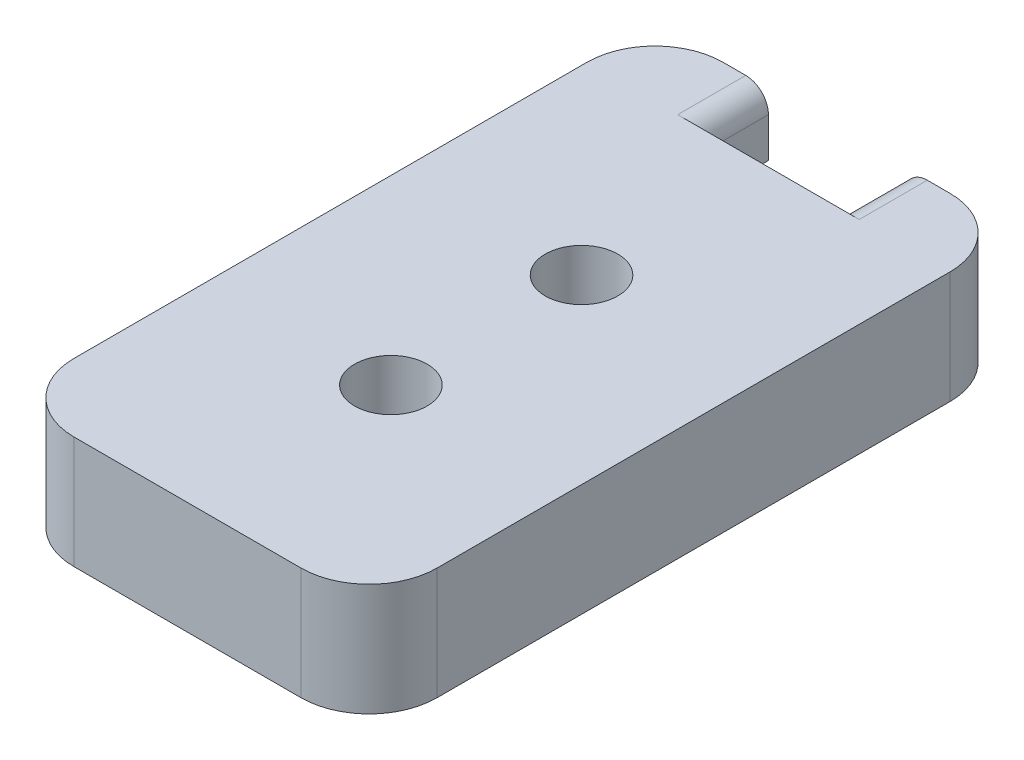
ISO-10303-21;
HEADER;
FILE_DESCRIPTION(('STEP AP214'),'2;1');
FILE_NAME('part.step','',(''),(''),'','','');
FILE_SCHEMA(('AUTOMOTIVE_DESIGN { 1 0 10303 214 1 1 1 1 }'));
ENDSEC;
DATA;
#1=APPLICATION_CONTEXT('core data for automotive mechanical design processes');
#2=APPLICATION_PROTOCOL_DEFINITION('international standard','automotive_design',2000,#1);
#3=PRODUCT_CONTEXT('',#1,'mechanical');
#4=PRODUCT('Part','Part','',(#3));
#5=PRODUCT_RELATED_PRODUCT_CATEGORY('part','',(#4));
#6=PRODUCT_DEFINITION_FORMATION('','',#4);
#7=PRODUCT_DEFINITION_CONTEXT('part definition',#1,'design');
#8=PRODUCT_DEFINITION('design','',#6,#7);
#9=PRODUCT_DEFINITION_SHAPE('','',#8);
#10=(LENGTH_UNIT() NAMED_UNIT(*) SI_UNIT(.MILLI.,.METRE.));
#11=(NAMED_UNIT(*) PLANE_ANGLE_UNIT() SI_UNIT($,.RADIAN.));
#12=(NAMED_UNIT(*) SI_UNIT($,.STERADIAN.) SOLID_ANGLE_UNIT());
#13=UNCERTAINTY_MEASURE_WITH_UNIT(LENGTH_MEASURE(1.E-05),#10,'distance_accuracy_value','');
#14=(GEOMETRIC_REPRESENTATION_CONTEXT(3) GLOBAL_UNCERTAINTY_ASSIGNED_CONTEXT((#13)) GLOBAL_UNIT_ASSIGNED_CONTEXT((#10,
#11,#12)) REPRESENTATION_CONTEXT('',''));
#15=CARTESIAN_POINT('',(0.,0.,0.));
#16=DIRECTION('',(0.,0.,1.));
#17=DIRECTION('',(1.,0.,0.));
#18=AXIS2_PLACEMENT_3D('',#15,#16,#17);
#19=CARTESIAN_POINT('',(20.,-4.94999999999999,25.6));
#20=DIRECTION('',(0.,1.,0.));
#21=DIRECTION('',(-1.,0.,0.));
#22=AXIS2_PLACEMENT_3D('',#19,#20,#21);
#23=PLANE('',#22);
#24=CARTESIAN_POINT('',(9.99999999998913,-4.94999999999999,8.23674059051232));
#25=DIRECTION('',(0.,1.,0.));
#26=DIRECTION('',(0.,0.,1.));
#27=AXIS2_PLACEMENT_3D('',#24,#25,#26);
#28=CIRCLE('',#27,1.60000000001062);
#29=CARTESIAN_POINT('',(9.99999999998913,-4.94999999999999,9.83674059052293));
#30=VERTEX_POINT('',#29);
#31=EDGE_CURVE('E193',#30,#30,#28,.T.);
#32=ORIENTED_EDGE('',*,*,#31,.T.);
#33=EDGE_LOOP('',(#32));
#34=FACE_BOUND('',#33,.T.);
#35=CARTESIAN_POINT('',(9.99999999998913,-4.94999999999999,16.6367405905123));
#36=DIRECTION('',(0.,1.,0.));
#37=DIRECTION('',(0.,0.,1.));
#38=AXIS2_PLACEMENT_3D('',#35,#36,#37);
#39=CIRCLE('',#38,1.60000000001062);
#40=CARTESIAN_POINT('',(9.99999999998913,-4.94999999999999,18.2367405905229));
#41=VERTEX_POINT('',#40);
#42=EDGE_CURVE('E200',#41,#41,#39,.T.);
#43=ORIENTED_EDGE('',*,*,#42,.T.);
#44=EDGE_LOOP('',(#43));
#45=FACE_BOUND('',#44,.T.);
#46=DIRECTION('',(0.,0.,-1.));
#47=VECTOR('',#46,1.);
#48=CARTESIAN_POINT('',(18.,-4.94999999999999,25.6));
#49=LINE('',#48,#47);
#50=CARTESIAN_POINT('',(18.,-4.94999999999999,22.6));
#51=VERTEX_POINT('',#50);
#52=CARTESIAN_POINT('',(18.,-4.94999999999999,0.));
#53=VERTEX_POINT('',#52);
#54=EDGE_CURVE('E287',#51,#53,#49,.T.);
#55=ORIENTED_EDGE('',*,*,#54,.F.);
#56=CARTESIAN_POINT('',(15.,-4.94999999999999,22.6));
#57=DIRECTION('',(0.,1.,0.));
#58=DIRECTION('',(-1.,0.,0.));
#59=AXIS2_PLACEMENT_3D('',#56,#57,#58);
#60=CIRCLE('',#59,3.);
#61=CARTESIAN_POINT('',(15.,-4.94999999999999,25.6));
#62=VERTEX_POINT('',#61);
#63=EDGE_CURVE('E254',#51,#62,#60,.F.);
#64=ORIENTED_EDGE('',*,*,#63,.T.);
#65=DIRECTION('',(1.,0.,0.));
#66=VECTOR('',#65,1.);
#67=CARTESIAN_POINT('',(20.,-4.94999999999999,25.6));
#68=LINE('',#67,#66);
#69=CARTESIAN_POINT('',(5.,-4.94999999999999,25.6));
#70=VERTEX_POINT('',#69);
#71=EDGE_CURVE('E196',#70,#62,#68,.T.);
#72=ORIENTED_EDGE('',*,*,#71,.F.);
#73=CARTESIAN_POINT('',(5.,-4.94999999999999,22.6));
#74=DIRECTION('',(0.,1.,0.));
#75=DIRECTION('',(-1.,0.,0.));
#76=AXIS2_PLACEMENT_3D('',#73,#74,#75);
#77=CIRCLE('',#76,3.);
#78=CARTESIAN_POINT('',(2.,-4.94999999999999,22.6));
#79=VERTEX_POINT('',#78);
#80=EDGE_CURVE('E252',#70,#79,#77,.F.);
#81=ORIENTED_EDGE('',*,*,#80,.T.);
#82=DIRECTION('',(0.,0.,-1.));
#83=VECTOR('',#82,1.);
#84=CARTESIAN_POINT('',(2.,-4.94999999999999,25.6));
#85=LINE('',#84,#83);
#86=CARTESIAN_POINT('',(2.,-4.94999999999999,0.));
#87=VERTEX_POINT('',#86);
#88=EDGE_CURVE('E268',#79,#87,#85,.T.);
#89=ORIENTED_EDGE('',*,*,#88,.T.);
#90=CARTESIAN_POINT('',(5.,-4.94999999999999,0.));
#91=DIRECTION('',(0.,1.,0.));
#92=DIRECTION('',(-1.,0.,0.));
#93=AXIS2_PLACEMENT_3D('',#90,#91,#92);
#94=CIRCLE('',#93,3.);
#95=CARTESIAN_POINT('',(5.,-4.94999999999999,-3.));
#96=VERTEX_POINT('',#95);
#97=EDGE_CURVE('E48',#87,#96,#94,.F.);
#98=ORIENTED_EDGE('',*,*,#97,.T.);
#99=DIRECTION('',(-1.,0.,0.));
#100=VECTOR('',#99,1.);
#101=CARTESIAN_POINT('',(20.,-4.94999999999999,-3.));
#102=LINE('',#101,#100);
#103=CARTESIAN_POINT('',(15.,-4.94999999999999,-3.));
#104=VERTEX_POINT('',#103);
#105=EDGE_CURVE('E174',#104,#96,#102,.T.);
#106=ORIENTED_EDGE('',*,*,#105,.F.);
#107=CARTESIAN_POINT('',(15.,-4.94999999999999,0.));
#108=DIRECTION('',(0.,1.,0.));
#109=DIRECTION('',(-1.,0.,0.));
#110=AXIS2_PLACEMENT_3D('',#107,#108,#109);
#111=CIRCLE('',#110,3.);
#112=EDGE_CURVE('E249',#104,#53,#111,.F.);
#113=ORIENTED_EDGE('',*,*,#112,.T.);
#114=EDGE_LOOP('',(#55,#64,#72,#81,#89,#98,#106,#113));
#115=FACE_BOUND('',#114,.T.);
#116=ADVANCED_FACE('F33',(#34,#45,#115),#23,.F.);
#117=CARTESIAN_POINT('',(0.,0.,25.6));
#118=DIRECTION('',(0.,-1.,0.));
#119=DIRECTION('',(0.,0.,-1.));
#120=AXIS2_PLACEMENT_3D('',#117,#118,#119);
#121=PLANE('',#120);
#122=CARTESIAN_POINT('',(9.99999999998913,0.,8.23674059051232));
#123=DIRECTION('',(0.,1.,0.));
#124=DIRECTION('',(0.,0.,1.));
#125=AXIS2_PLACEMENT_3D('',#122,#123,#124);
#126=CIRCLE('',#125,1.60000000001062);
#127=CARTESIAN_POINT('',(9.99999999998913,0.,9.83674059052293));
#128=VERTEX_POINT('',#127);
#129=EDGE_CURVE('E197',#128,#128,#126,.T.);
#130=ORIENTED_EDGE('',*,*,#129,.F.);
#131=EDGE_LOOP('',(#130));
#132=FACE_BOUND('',#131,.T.);
#133=CARTESIAN_POINT('',(9.99999999998913,0.,16.6367405905123));
#134=DIRECTION('',(0.,1.,0.));
#135=DIRECTION('',(0.,0.,1.));
#136=AXIS2_PLACEMENT_3D('',#133,#134,#135);
#137=CIRCLE('',#136,1.60000000001062);
#138=CARTESIAN_POINT('',(9.99999999998913,0.,18.2367405905229));
#139=VERTEX_POINT('',#138);
#140=EDGE_CURVE('E192',#139,#139,#137,.T.);
#141=ORIENTED_EDGE('',*,*,#140,.F.);
#142=EDGE_LOOP('',(#141));
#143=FACE_BOUND('',#142,.T.);
#144=DIRECTION('',(-1.,0.,0.));
#145=VECTOR('',#144,1.);
#146=CARTESIAN_POINT('',(0.,0.,25.6));
#147=LINE('',#146,#145);
#148=CARTESIAN_POINT('',(15.,0.,25.6));
#149=VERTEX_POINT('',#148);
#150=CARTESIAN_POINT('',(5.,0.,25.6));
#151=VERTEX_POINT('',#150);
#152=EDGE_CURVE('E207',#149,#151,#147,.T.);
#153=ORIENTED_EDGE('',*,*,#152,.F.);
#154=CARTESIAN_POINT('',(15.,0.,22.6));
#155=DIRECTION('',(0.,-1.,0.));
#156=DIRECTION('',(0.,0.,-1.));
#157=AXIS2_PLACEMENT_3D('',#154,#155,#156);
#158=CIRCLE('',#157,3.);
#159=CARTESIAN_POINT('',(18.,0.,22.6));
#160=VERTEX_POINT('',#159);
#161=EDGE_CURVE('E242',#149,#160,#158,.F.);
#162=ORIENTED_EDGE('',*,*,#161,.T.);
#163=DIRECTION('',(0.,0.,-1.));
#164=VECTOR('',#163,1.);
#165=CARTESIAN_POINT('',(18.,0.,25.6));
#166=LINE('',#165,#164);
#167=CARTESIAN_POINT('',(18.,0.,0.));
#168=VERTEX_POINT('',#167);
#169=EDGE_CURVE('E276',#160,#168,#166,.T.);
#170=ORIENTED_EDGE('',*,*,#169,.T.);
#171=CARTESIAN_POINT('',(15.,0.,0.));
#172=DIRECTION('',(0.,-1.,0.));
#173=DIRECTION('',(0.,0.,-1.));
#174=AXIS2_PLACEMENT_3D('',#171,#172,#173);
#175=CIRCLE('',#174,3.);
#176=CARTESIAN_POINT('',(15.,0.,-3.));
#177=VERTEX_POINT('',#176);
#178=EDGE_CURVE('E236',#168,#177,#175,.F.);
#179=ORIENTED_EDGE('',*,*,#178,.T.);
#180=DIRECTION('',(1.,0.,0.));
#181=VECTOR('',#180,1.);
#182=CARTESIAN_POINT('',(0.,0.,-3.));
#183=LINE('',#182,#181);
#184=CARTESIAN_POINT('',(14.,0.,-3.));
#185=VERTEX_POINT('',#184);
#186=EDGE_CURVE('E189',#185,#177,#183,.T.);
#187=ORIENTED_EDGE('',*,*,#186,.F.);
#188=DIRECTION('',(0.,0.,-1.));
#189=VECTOR('',#188,1.);
#190=CARTESIAN_POINT('',(14.,0.,25.6));
#191=LINE('',#190,#189);
#192=CARTESIAN_POINT('',(14.,0.,0.));
#193=VERTEX_POINT('',#192);
#194=EDGE_CURVE('E210',#185,#193,#191,.F.);
#195=ORIENTED_EDGE('',*,*,#194,.T.);
#196=DIRECTION('',(1.,0.,0.));
#197=VECTOR('',#196,1.);
#198=CARTESIAN_POINT('',(10.,0.,0.));
#199=LINE('',#198,#197);
#200=CARTESIAN_POINT('',(6.,0.,0.));
#201=VERTEX_POINT('',#200);
#202=EDGE_CURVE('E176',#201,#193,#199,.T.);
#203=ORIENTED_EDGE('',*,*,#202,.F.);
#204=DIRECTION('',(0.,0.,-1.));
#205=VECTOR('',#204,1.);
#206=CARTESIAN_POINT('',(6.,0.,25.6));
#207=LINE('',#206,#205);
#208=CARTESIAN_POINT('',(6.,0.,-3.));
#209=VERTEX_POINT('',#208);
#210=EDGE_CURVE('E213',#201,#209,#207,.T.);
#211=ORIENTED_EDGE('',*,*,#210,.T.);
#212=CARTESIAN_POINT('',(5.,0.,-3.));
#213=VERTEX_POINT('',#212);
#214=EDGE_CURVE('E190',#213,#209,#183,.T.);
#215=ORIENTED_EDGE('',*,*,#214,.F.);
#216=CARTESIAN_POINT('',(5.,0.,0.));
#217=DIRECTION('',(0.,-1.,0.));
#218=DIRECTION('',(0.,0.,-1.));
#219=AXIS2_PLACEMENT_3D('',#216,#217,#218);
#220=CIRCLE('',#219,3.);
#221=CARTESIAN_POINT('',(2.,0.,0.));
#222=VERTEX_POINT('',#221);
#223=EDGE_CURVE('E238',#213,#222,#220,.F.);
#224=ORIENTED_EDGE('',*,*,#223,.T.);
#225=DIRECTION('',(0.,0.,-1.));
#226=VECTOR('',#225,1.);
#227=CARTESIAN_POINT('',(2.,0.,25.6));
#228=LINE('',#227,#226);
#229=CARTESIAN_POINT('',(2.,0.,22.6));
#230=VERTEX_POINT('',#229);
#231=EDGE_CURVE('E266',#230,#222,#228,.T.);
#232=ORIENTED_EDGE('',*,*,#231,.F.);
#233=CARTESIAN_POINT('',(5.,0.,22.6));
#234=DIRECTION('',(0.,-1.,0.));
#235=DIRECTION('',(0.,0.,-1.));
#236=AXIS2_PLACEMENT_3D('',#233,#234,#235);
#237=CIRCLE('',#236,3.);
#238=EDGE_CURVE('E240',#230,#151,#237,.F.);
#239=ORIENTED_EDGE('',*,*,#238,.T.);
#240=EDGE_LOOP('',(#153,#162,#170,#179,#187,#195,#203,#211,#215,#224,#232,#239));
#241=FACE_BOUND('',#240,.T.);
#242=ADVANCED_FACE('F273',(#132,#143,#241),#121,.F.);
#243=CARTESIAN_POINT('',(0.,0.,25.6));
#244=DIRECTION('',(0.,0.,-1.));
#245=DIRECTION('',(-1.,0.,0.));
#246=AXIS2_PLACEMENT_3D('',#243,#244,#245);
#247=PLANE('',#246);
#248=ORIENTED_EDGE('',*,*,#71,.T.);
#249=DIRECTION('',(0.,1.,0.));
#250=VECTOR('',#249,1.);
#251=CARTESIAN_POINT('',(15.,0.,25.6));
#252=LINE('',#251,#250);
#253=EDGE_CURVE('E233',#62,#149,#252,.T.);
#254=ORIENTED_EDGE('',*,*,#253,.T.);
#255=ORIENTED_EDGE('',*,*,#152,.T.);
#256=DIRECTION('',(0.,-1.,0.));
#257=VECTOR('',#256,1.);
#258=CARTESIAN_POINT('',(5.,0.,25.6));
#259=LINE('',#258,#257);
#260=EDGE_CURVE('E230',#151,#70,#259,.T.);
#261=ORIENTED_EDGE('',*,*,#260,.T.);
#262=EDGE_LOOP('',(#248,#254,#255,#261));
#263=FACE_BOUND('',#262,.T.);
#264=ADVANCED_FACE('F282',(#263),#247,.F.);
#265=CARTESIAN_POINT('',(9.99999999998913,-4.94999999999999,16.6367405905123));
#266=DIRECTION('',(0.,1.,0.));
#267=DIRECTION('',(0.,0.,1.));
#268=AXIS2_PLACEMENT_3D('',#265,#266,#267);
#269=CYLINDRICAL_SURFACE('',#268,1.60000000001062);
#270=ORIENTED_EDGE('',*,*,#42,.F.);
#271=EDGE_LOOP('',(#270));
#272=FACE_BOUND('',#271,.T.);
#273=ORIENTED_EDGE('',*,*,#140,.T.);
#274=EDGE_LOOP('',(#273));
#275=FACE_BOUND('',#274,.T.);
#276=ADVANCED_FACE('F462',(#272,#275),#269,.F.);
#277=CARTESIAN_POINT('',(9.99999999998913,-4.94999999999999,8.23674059051232));
#278=DIRECTION('',(0.,1.,0.));
#279=DIRECTION('',(0.,0.,1.));
#280=AXIS2_PLACEMENT_3D('',#277,#278,#279);
#281=CYLINDRICAL_SURFACE('',#280,1.60000000001062);
#282=ORIENTED_EDGE('',*,*,#31,.F.);
#283=EDGE_LOOP('',(#282));
#284=FACE_BOUND('',#283,.T.);
#285=ORIENTED_EDGE('',*,*,#129,.T.);
#286=EDGE_LOOP('',(#285));
#287=FACE_BOUND('',#286,.T.);
#288=ADVANCED_FACE('F458',(#284,#287),#281,.F.);
#289=CARTESIAN_POINT('',(0.,0.,-3.));
#290=DIRECTION('',(0.,0.,-1.));
#291=DIRECTION('',(-1.,0.,0.));
#292=AXIS2_PLACEMENT_3D('',#289,#290,#291);
#293=PLANE('',#292);
#294=ORIENTED_EDGE('',*,*,#105,.T.);
#295=DIRECTION('',(0.,-1.,0.));
#296=VECTOR('',#295,1.);
#297=CARTESIAN_POINT('',(5.,0.,-3.));
#298=LINE('',#297,#296);
#299=EDGE_CURVE('E11',#96,#213,#298,.F.);
#300=ORIENTED_EDGE('',*,*,#299,.T.);
#301=ORIENTED_EDGE('',*,*,#214,.T.);
#302=CARTESIAN_POINT('',(6.,-1.,-3.));
#303=DIRECTION('',(0.,0.,-1.));
#304=DIRECTION('',(-1.,0.,0.));
#305=AXIS2_PLACEMENT_3D('',#302,#303,#304);
#306=CIRCLE('',#305,1.);
#307=CARTESIAN_POINT('',(7.,-1.,-3.));
#308=VERTEX_POINT('',#307);
#309=EDGE_CURVE('E218',#209,#308,#306,.T.);
#310=ORIENTED_EDGE('',*,*,#309,.T.);
#311=DIRECTION('',(0.,1.,0.));
#312=VECTOR('',#311,1.);
#313=CARTESIAN_POINT('',(7.,-3.,-3.));
#314=LINE('',#313,#312);
#315=CARTESIAN_POINT('',(7.,-2.75,-3.));
#316=VERTEX_POINT('',#315);
#317=EDGE_CURVE('E185',#316,#308,#314,.T.);
#318=ORIENTED_EDGE('',*,*,#317,.F.);
#319=CARTESIAN_POINT('',(7.,-3.,-3.));
#320=DIRECTION('',(0.,0.,-1.));
#321=DIRECTION('',(-1.,0.,0.));
#322=AXIS2_PLACEMENT_3D('',#319,#320,#321);
#323=CIRCLE('',#322,0.249999999999999);
#324=CARTESIAN_POINT('',(7.25,-3.,-3.));
#325=VERTEX_POINT('',#324);
#326=EDGE_CURVE('E167',#325,#316,#323,.T.);
#327=ORIENTED_EDGE('',*,*,#326,.F.);
#328=DIRECTION('',(-1.,0.,0.));
#329=VECTOR('',#328,1.);
#330=CARTESIAN_POINT('',(13.,-3.,-3.));
#331=LINE('',#330,#329);
#332=CARTESIAN_POINT('',(12.75,-3.,-3.));
#333=VERTEX_POINT('',#332);
#334=EDGE_CURVE('E182',#333,#325,#331,.T.);
#335=ORIENTED_EDGE('',*,*,#334,.F.);
#336=CARTESIAN_POINT('',(13.,-3.,-3.));
#337=DIRECTION('',(0.,0.,-1.));
#338=DIRECTION('',(-1.,0.,0.));
#339=AXIS2_PLACEMENT_3D('',#336,#337,#338);
#340=CIRCLE('',#339,0.250000000000001);
#341=CARTESIAN_POINT('',(13.,-2.75,-3.));
#342=VERTEX_POINT('',#341);
#343=EDGE_CURVE('E152',#342,#333,#340,.T.);
#344=ORIENTED_EDGE('',*,*,#343,.F.);
#345=DIRECTION('',(0.,-1.,0.));
#346=VECTOR('',#345,1.);
#347=CARTESIAN_POINT('',(13.,0.,-3.));
#348=LINE('',#347,#346);
#349=CARTESIAN_POINT('',(13.,-1.,-3.));
#350=VERTEX_POINT('',#349);
#351=EDGE_CURVE('E180',#350,#342,#348,.T.);
#352=ORIENTED_EDGE('',*,*,#351,.F.);
#353=CARTESIAN_POINT('',(14.,-1.,-3.));
#354=DIRECTION('',(0.,0.,-1.));
#355=DIRECTION('',(-1.,0.,0.));
#356=AXIS2_PLACEMENT_3D('',#353,#354,#355);
#357=CIRCLE('',#356,1.);
#358=EDGE_CURVE('E216',#350,#185,#357,.T.);
#359=ORIENTED_EDGE('',*,*,#358,.T.);
#360=ORIENTED_EDGE('',*,*,#186,.T.);
#361=DIRECTION('',(0.,1.,0.));
#362=VECTOR('',#361,1.);
#363=CARTESIAN_POINT('',(15.,-4.94999999999999,-3.));
#364=LINE('',#363,#362);
#365=EDGE_CURVE('E41',#177,#104,#364,.F.);
#366=ORIENTED_EDGE('',*,*,#365,.T.);
#367=EDGE_LOOP('',(#294,#300,#301,#310,#318,#327,#335,#344,#352,#359,#360,#366));
#368=FACE_BOUND('',#367,.T.);
#369=ADVANCED_FACE('F318',(#368),#293,.T.);
#370=CARTESIAN_POINT('',(7.,-3.,0.));
#371=DIRECTION('',(-1.,0.,0.));
#372=DIRECTION('',(0.,0.,1.));
#373=AXIS2_PLACEMENT_3D('',#370,#371,#372);
#374=PLANE('',#373);
#375=ORIENTED_EDGE('',*,*,#317,.T.);
#376=DIRECTION('',(0.,0.,-1.));
#377=VECTOR('',#376,1.);
#378=CARTESIAN_POINT('',(7.,-1.,0.));
#379=LINE('',#378,#377);
#380=CARTESIAN_POINT('',(7.,-1.,0.));
#381=VERTEX_POINT('',#380);
#382=EDGE_CURVE('E220',#308,#381,#379,.F.);
#383=ORIENTED_EDGE('',*,*,#382,.T.);
#384=DIRECTION('',(0.,1.,0.));
#385=VECTOR('',#384,1.);
#386=CARTESIAN_POINT('',(7.,-3.,0.));
#387=LINE('',#386,#385);
#388=CARTESIAN_POINT('',(7.,-2.75,0.));
#389=VERTEX_POINT('',#388);
#390=EDGE_CURVE('E171',#389,#381,#387,.T.);
#391=ORIENTED_EDGE('',*,*,#390,.F.);
#392=DIRECTION('',(0.,0.,-1.));
#393=VECTOR('',#392,1.);
#394=CARTESIAN_POINT('',(7.,-2.75,0.));
#395=LINE('',#394,#393);
#396=EDGE_CURVE('E183',#389,#316,#395,.T.);
#397=ORIENTED_EDGE('',*,*,#396,.T.);
#398=EDGE_LOOP('',(#375,#383,#391,#397));
#399=FACE_BOUND('',#398,.T.);
#400=ADVANCED_FACE('F325',(#399),#374,.F.);
#401=CARTESIAN_POINT('',(13.,-3.,0.));
#402=DIRECTION('',(0.,-1.,0.));
#403=DIRECTION('',(0.,0.,-1.));
#404=AXIS2_PLACEMENT_3D('',#401,#402,#403);
#405=PLANE('',#404);
#406=ORIENTED_EDGE('',*,*,#334,.T.);
#407=DIRECTION('',(0.,0.,-1.));
#408=VECTOR('',#407,1.);
#409=CARTESIAN_POINT('',(7.25,-3.,0.));
#410=LINE('',#409,#408);
#411=CARTESIAN_POINT('',(7.25,-3.,0.));
#412=VERTEX_POINT('',#411);
#413=EDGE_CURVE('E157',#325,#412,#410,.F.);
#414=ORIENTED_EDGE('',*,*,#413,.T.);
#415=DIRECTION('',(-1.,0.,0.));
#416=VECTOR('',#415,1.);
#417=CARTESIAN_POINT('',(13.,-3.,0.));
#418=LINE('',#417,#416);
#419=CARTESIAN_POINT('',(12.75,-3.,0.));
#420=VERTEX_POINT('',#419);
#421=EDGE_CURVE('E164',#420,#412,#418,.T.);
#422=ORIENTED_EDGE('',*,*,#421,.F.);
#423=DIRECTION('',(0.,0.,-1.));
#424=VECTOR('',#423,1.);
#425=CARTESIAN_POINT('',(12.75,-3.,0.));
#426=LINE('',#425,#424);
#427=EDGE_CURVE('E145',#420,#333,#426,.T.);
#428=ORIENTED_EDGE('',*,*,#427,.T.);
#429=EDGE_LOOP('',(#406,#414,#422,#428));
#430=FACE_BOUND('',#429,.T.);
#431=ADVANCED_FACE('F170',(#430),#405,.F.);
#432=CARTESIAN_POINT('',(13.,0.,0.));
#433=DIRECTION('',(1.,0.,0.));
#434=DIRECTION('',(0.,0.,-1.));
#435=AXIS2_PLACEMENT_3D('',#432,#433,#434);
#436=PLANE('',#435);
#437=DIRECTION('',(0.,-1.,0.));
#438=VECTOR('',#437,1.);
#439=CARTESIAN_POINT('',(13.,0.,0.));
#440=LINE('',#439,#438);
#441=CARTESIAN_POINT('',(13.,-1.,0.));
#442=VERTEX_POINT('',#441);
#443=CARTESIAN_POINT('',(13.,-2.75,0.));
#444=VERTEX_POINT('',#443);
#445=EDGE_CURVE('E166',#442,#444,#440,.T.);
#446=ORIENTED_EDGE('',*,*,#445,.F.);
#447=DIRECTION('',(0.,0.,-1.));
#448=VECTOR('',#447,1.);
#449=CARTESIAN_POINT('',(13.,-1.,0.));
#450=LINE('',#449,#448);
#451=EDGE_CURVE('E222',#442,#350,#450,.T.);
#452=ORIENTED_EDGE('',*,*,#451,.T.);
#453=ORIENTED_EDGE('',*,*,#351,.T.);
#454=DIRECTION('',(0.,0.,-1.));
#455=VECTOR('',#454,1.);
#456=CARTESIAN_POINT('',(13.,-2.75,0.));
#457=LINE('',#456,#455);
#458=EDGE_CURVE('E158',#342,#444,#457,.F.);
#459=ORIENTED_EDGE('',*,*,#458,.T.);
#460=EDGE_LOOP('',(#446,#452,#453,#459));
#461=FACE_BOUND('',#460,.T.);
#462=ADVANCED_FACE('F317',(#461),#436,.F.);
#463=CARTESIAN_POINT('',(0.,0.,0.));
#464=DIRECTION('',(0.,0.,-1.));
#465=DIRECTION('',(-1.,0.,0.));
#466=AXIS2_PLACEMENT_3D('',#463,#464,#465);
#467=PLANE('',#466);
#468=CARTESIAN_POINT('',(7.,-3.,0.));
#469=DIRECTION('',(0.,0.,-1.));
#470=DIRECTION('',(-1.,0.,0.));
#471=AXIS2_PLACEMENT_3D('',#468,#469,#470);
#472=CIRCLE('',#471,0.249999999999999);
#473=EDGE_CURVE('E300',#412,#389,#472,.T.);
#474=ORIENTED_EDGE('',*,*,#473,.T.);
#475=ORIENTED_EDGE('',*,*,#390,.T.);
#476=CARTESIAN_POINT('',(6.,-1.,0.));
#477=DIRECTION('',(0.,0.,-1.));
#478=DIRECTION('',(-1.,0.,0.));
#479=AXIS2_PLACEMENT_3D('',#476,#477,#478);
#480=CIRCLE('',#479,1.);
#481=EDGE_CURVE('E225',#381,#201,#480,.F.);
#482=ORIENTED_EDGE('',*,*,#481,.T.);
#483=ORIENTED_EDGE('',*,*,#202,.T.);
#484=CARTESIAN_POINT('',(14.,-1.,0.));
#485=DIRECTION('',(0.,0.,-1.));
#486=DIRECTION('',(-1.,0.,0.));
#487=AXIS2_PLACEMENT_3D('',#484,#485,#486);
#488=CIRCLE('',#487,1.);
#489=EDGE_CURVE('E228',#193,#442,#488,.F.);
#490=ORIENTED_EDGE('',*,*,#489,.T.);
#491=ORIENTED_EDGE('',*,*,#445,.T.);
#492=CARTESIAN_POINT('',(13.,-3.,0.));
#493=DIRECTION('',(0.,0.,-1.));
#494=DIRECTION('',(-1.,0.,0.));
#495=AXIS2_PLACEMENT_3D('',#492,#493,#494);
#496=CIRCLE('',#495,0.250000000000001);
#497=EDGE_CURVE('E149',#444,#420,#496,.T.);
#498=ORIENTED_EDGE('',*,*,#497,.T.);
#499=ORIENTED_EDGE('',*,*,#421,.T.);
#500=EDGE_LOOP('',(#474,#475,#482,#483,#490,#491,#498,#499));
#501=FACE_BOUND('',#500,.T.);
#502=ADVANCED_FACE('F163',(#501),#467,.T.);
#503=CARTESIAN_POINT('',(13.,-3.,0.));
#504=DIRECTION('',(0.,0.,-1.));
#505=DIRECTION('',(-1.,0.,0.));
#506=AXIS2_PLACEMENT_3D('',#503,#504,#505);
#507=CYLINDRICAL_SURFACE('',#506,0.250000000000001);
#508=ORIENTED_EDGE('',*,*,#497,.F.);
#509=ORIENTED_EDGE('',*,*,#458,.F.);
#510=ORIENTED_EDGE('',*,*,#343,.T.);
#511=ORIENTED_EDGE('',*,*,#427,.F.);
#512=EDGE_LOOP('',(#508,#509,#510,#511));
#513=FACE_BOUND('',#512,.T.);
#514=ADVANCED_FACE('F147',(#513),#507,.F.);
#515=CARTESIAN_POINT('',(7.,-3.,0.));
#516=DIRECTION('',(0.,0.,-1.));
#517=DIRECTION('',(-1.,0.,0.));
#518=AXIS2_PLACEMENT_3D('',#515,#516,#517);
#519=CYLINDRICAL_SURFACE('',#518,0.249999999999999);
#520=ORIENTED_EDGE('',*,*,#473,.F.);
#521=ORIENTED_EDGE('',*,*,#413,.F.);
#522=ORIENTED_EDGE('',*,*,#326,.T.);
#523=ORIENTED_EDGE('',*,*,#396,.F.);
#524=EDGE_LOOP('',(#520,#521,#522,#523));
#525=FACE_BOUND('',#524,.T.);
#526=ADVANCED_FACE('F322',(#525),#519,.F.);
#527=CARTESIAN_POINT('',(6.,-1.,25.6));
#528=DIRECTION('',(0.,0.,-1.));
#529=DIRECTION('',(-1.,0.,0.));
#530=AXIS2_PLACEMENT_3D('',#527,#528,#529);
#531=CYLINDRICAL_SURFACE('',#530,1.);
#532=ORIENTED_EDGE('',*,*,#481,.F.);
#533=ORIENTED_EDGE('',*,*,#382,.F.);
#534=ORIENTED_EDGE('',*,*,#309,.F.);
#535=ORIENTED_EDGE('',*,*,#210,.F.);
#536=EDGE_LOOP('',(#532,#533,#534,#535));
#537=FACE_BOUND('',#536,.T.);
#538=ADVANCED_FACE('F328',(#537),#531,.T.);
#539=CARTESIAN_POINT('',(14.,-1.,0.));
#540=DIRECTION('',(0.,0.,-1.));
#541=DIRECTION('',(-1.,0.,0.));
#542=AXIS2_PLACEMENT_3D('',#539,#540,#541);
#543=CYLINDRICAL_SURFACE('',#542,1.);
#544=ORIENTED_EDGE('',*,*,#489,.F.);
#545=ORIENTED_EDGE('',*,*,#194,.F.);
#546=ORIENTED_EDGE('',*,*,#358,.F.);
#547=ORIENTED_EDGE('',*,*,#451,.F.);
#548=EDGE_LOOP('',(#544,#545,#546,#547));
#549=FACE_BOUND('',#548,.T.);
#550=ADVANCED_FACE('F314',(#549),#543,.T.);
#551=CARTESIAN_POINT('',(18.,0.,25.6));
#552=DIRECTION('',(-1.,0.,0.));
#553=DIRECTION('',(0.,0.,1.));
#554=AXIS2_PLACEMENT_3D('',#551,#552,#553);
#555=PLANE('',#554);
#556=ORIENTED_EDGE('',*,*,#169,.F.);
#557=DIRECTION('',(0.,1.,0.));
#558=VECTOR('',#557,1.);
#559=CARTESIAN_POINT('',(18.,0.,22.6));
#560=LINE('',#559,#558);
#561=EDGE_CURVE('E247',#160,#51,#560,.F.);
#562=ORIENTED_EDGE('',*,*,#561,.T.);
#563=ORIENTED_EDGE('',*,*,#54,.T.);
#564=DIRECTION('',(0.,1.,0.));
#565=VECTOR('',#564,1.);
#566=CARTESIAN_POINT('',(18.,0.,0.));
#567=LINE('',#566,#565);
#568=EDGE_CURVE('E244',#53,#168,#567,.T.);
#569=ORIENTED_EDGE('',*,*,#568,.T.);
#570=EDGE_LOOP('',(#556,#562,#563,#569));
#571=FACE_BOUND('',#570,.T.);
#572=ADVANCED_FACE('F294',(#571),#555,.F.);
#573=CARTESIAN_POINT('',(2.,0.,25.6));
#574=DIRECTION('',(1.,0.,0.));
#575=DIRECTION('',(0.,1.,0.));
#576=AXIS2_PLACEMENT_3D('',#573,#574,#575);
#577=PLANE('',#576);
#578=ORIENTED_EDGE('',*,*,#88,.F.);
#579=DIRECTION('',(0.,-1.,0.));
#580=VECTOR('',#579,1.);
#581=CARTESIAN_POINT('',(2.,0.,22.6));
#582=LINE('',#581,#580);
#583=EDGE_CURVE('E259',#79,#230,#582,.F.);
#584=ORIENTED_EDGE('',*,*,#583,.T.);
#585=ORIENTED_EDGE('',*,*,#231,.T.);
#586=DIRECTION('',(0.,-1.,0.));
#587=VECTOR('',#586,1.);
#588=CARTESIAN_POINT('',(2.,-4.94999999999999,0.));
#589=LINE('',#588,#587);
#590=EDGE_CURVE('E256',#222,#87,#589,.T.);
#591=ORIENTED_EDGE('',*,*,#590,.T.);
#592=EDGE_LOOP('',(#578,#584,#585,#591));
#593=FACE_BOUND('',#592,.T.);
#594=ADVANCED_FACE('F265',(#593),#577,.F.);
#595=CARTESIAN_POINT('',(15.,0.,22.6));
#596=DIRECTION('',(0.,1.,0.));
#597=DIRECTION('',(0.,0.,1.));
#598=AXIS2_PLACEMENT_3D('',#595,#596,#597);
#599=CYLINDRICAL_SURFACE('',#598,3.);
#600=ORIENTED_EDGE('',*,*,#63,.F.);
#601=ORIENTED_EDGE('',*,*,#561,.F.);
#602=ORIENTED_EDGE('',*,*,#161,.F.);
#603=ORIENTED_EDGE('',*,*,#253,.F.);
#604=EDGE_LOOP('',(#600,#601,#602,#603));
#605=FACE_BOUND('',#604,.T.);
#606=ADVANCED_FACE('F290',(#605),#599,.T.);
#607=CARTESIAN_POINT('',(5.,0.,22.6));
#608=DIRECTION('',(0.,-1.,0.));
#609=DIRECTION('',(1.,0.,0.));
#610=AXIS2_PLACEMENT_3D('',#607,#608,#609);
#611=CYLINDRICAL_SURFACE('',#610,3.);
#612=ORIENTED_EDGE('',*,*,#238,.F.);
#613=ORIENTED_EDGE('',*,*,#583,.F.);
#614=ORIENTED_EDGE('',*,*,#80,.F.);
#615=ORIENTED_EDGE('',*,*,#260,.F.);
#616=EDGE_LOOP('',(#612,#613,#614,#615));
#617=FACE_BOUND('',#616,.T.);
#618=ADVANCED_FACE('F279',(#617),#611,.T.);
#619=CARTESIAN_POINT('',(5.,0.,0.));
#620=DIRECTION('',(0.,1.,0.));
#621=DIRECTION('',(-1.,0.,0.));
#622=AXIS2_PLACEMENT_3D('',#619,#620,#621);
#623=CYLINDRICAL_SURFACE('',#622,3.);
#624=ORIENTED_EDGE('',*,*,#223,.F.);
#625=ORIENTED_EDGE('',*,*,#299,.F.);
#626=ORIENTED_EDGE('',*,*,#97,.F.);
#627=ORIENTED_EDGE('',*,*,#590,.F.);
#628=EDGE_LOOP('',(#624,#625,#626,#627));
#629=FACE_BOUND('',#628,.T.);
#630=ADVANCED_FACE('F332',(#629),#623,.T.);
#631=CARTESIAN_POINT('',(15.,0.,0.));
#632=DIRECTION('',(0.,-1.,0.));
#633=DIRECTION('',(0.,0.,-1.));
#634=AXIS2_PLACEMENT_3D('',#631,#632,#633);
#635=CYLINDRICAL_SURFACE('',#634,3.);
#636=ORIENTED_EDGE('',*,*,#112,.F.);
#637=ORIENTED_EDGE('',*,*,#365,.F.);
#638=ORIENTED_EDGE('',*,*,#178,.F.);
#639=ORIENTED_EDGE('',*,*,#568,.F.);
#640=EDGE_LOOP('',(#636,#637,#638,#639));
#641=FACE_BOUND('',#640,.T.);
#642=ADVANCED_FACE('F35',(#641),#635,.T.);
#643=CLOSED_SHELL('',(#116,#242,#264,#276,#288,#369,#400,#431,#462,#502,#514,#526,#538,#550,
#572,#594,#606,#618,#630,#642));
#644=MANIFOLD_SOLID_BREP('B2',#643);
#645=ADVANCED_BREP_SHAPE_REPRESENTATION('',(#18,#644),#14);
#646=SHAPE_DEFINITION_REPRESENTATION(#9,#645);
ENDSEC;
END-ISO-10303-21;
